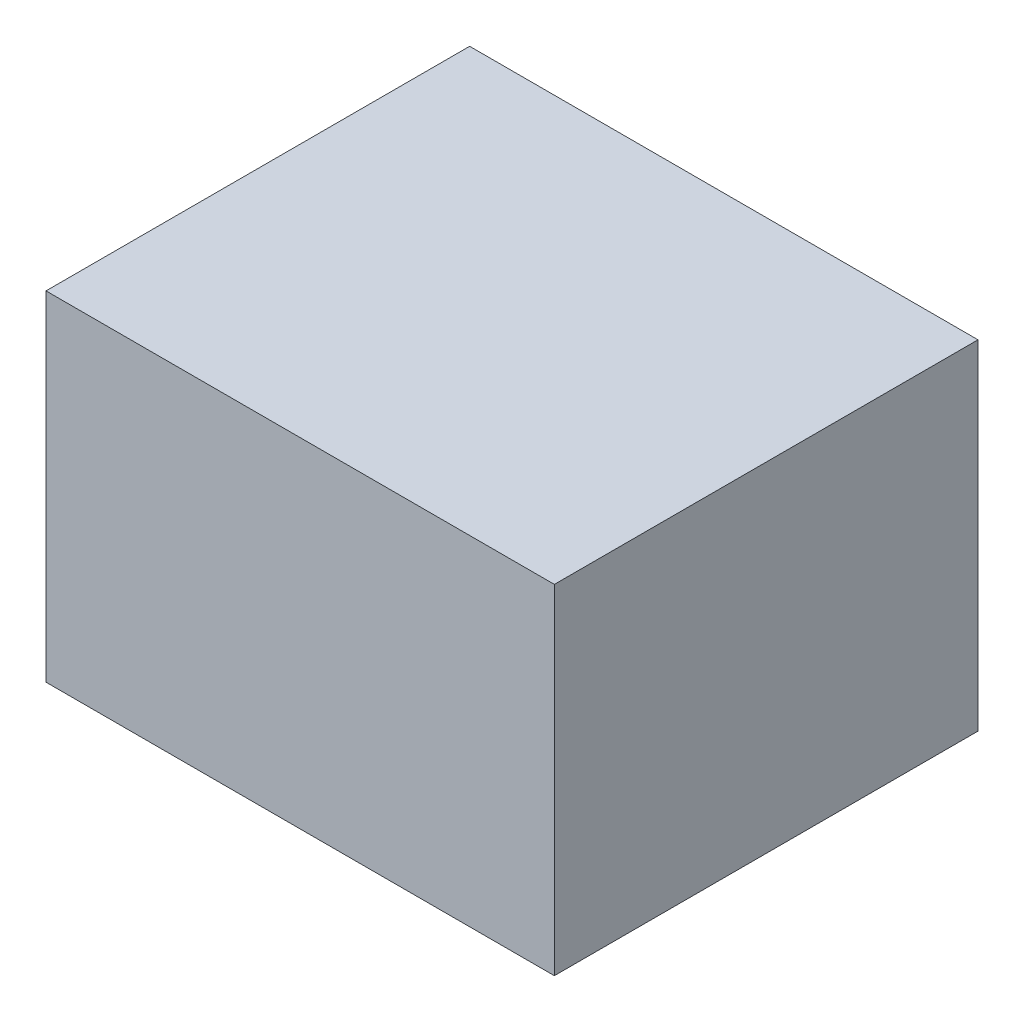
ISO-10303-21;
HEADER;
FILE_DESCRIPTION(('STEP AP214'),'2;1');
FILE_NAME('part.step','',(''),(''),'','','');
FILE_SCHEMA(('AUTOMOTIVE_DESIGN { 1 0 10303 214 1 1 1 1 }'));
ENDSEC;
DATA;
#1=APPLICATION_CONTEXT('core data for automotive mechanical design processes');
#2=APPLICATION_PROTOCOL_DEFINITION('international standard','automotive_design',2000,#1);
#3=PRODUCT_CONTEXT('',#1,'mechanical');
#4=PRODUCT('Part','Part','',(#3));
#5=PRODUCT_RELATED_PRODUCT_CATEGORY('part','',(#4));
#6=PRODUCT_DEFINITION_FORMATION('','',#4);
#7=PRODUCT_DEFINITION_CONTEXT('part definition',#1,'design');
#8=PRODUCT_DEFINITION('design','',#6,#7);
#9=PRODUCT_DEFINITION_SHAPE('','',#8);
#10=(LENGTH_UNIT() NAMED_UNIT(*) SI_UNIT(.MILLI.,.METRE.));
#11=(NAMED_UNIT(*) PLANE_ANGLE_UNIT() SI_UNIT($,.RADIAN.));
#12=(NAMED_UNIT(*) SI_UNIT($,.STERADIAN.) SOLID_ANGLE_UNIT());
#13=UNCERTAINTY_MEASURE_WITH_UNIT(LENGTH_MEASURE(1.E-05),#10,'distance_accuracy_value','');
#14=(GEOMETRIC_REPRESENTATION_CONTEXT(3) GLOBAL_UNCERTAINTY_ASSIGNED_CONTEXT((#13)) GLOBAL_UNIT_ASSIGNED_CONTEXT((#10,
#11,#12)) REPRESENTATION_CONTEXT('',''));
#15=CARTESIAN_POINT('',(0.,0.,0.));
#16=DIRECTION('',(0.,0.,1.));
#17=DIRECTION('',(1.,0.,0.));
#18=AXIS2_PLACEMENT_3D('',#15,#16,#17);
#19=CARTESIAN_POINT('',(19.05,-12.7,-15.875));
#20=DIRECTION('',(0.,0.,1.));
#21=DIRECTION('',(1.,0.,0.));
#22=AXIS2_PLACEMENT_3D('',#19,#20,#21);
#23=PLANE('',#22);
#24=DIRECTION('',(0.,1.,0.));
#25=VECTOR('',#24,1.);
#26=CARTESIAN_POINT('',(-19.05,-12.7,-15.875));
#27=LINE('',#26,#25);
#28=CARTESIAN_POINT('',(-19.05,-12.7,-15.875));
#29=VERTEX_POINT('',#28);
#30=CARTESIAN_POINT('',(-19.05,12.7,-15.875));
#31=VERTEX_POINT('',#30);
#32=EDGE_CURVE('E100',#29,#31,#27,.T.);
#33=ORIENTED_EDGE('',*,*,#32,.T.);
#34=DIRECTION('',(-1.,0.,0.));
#35=VECTOR('',#34,1.);
#36=CARTESIAN_POINT('',(19.05,12.7,-15.875));
#37=LINE('',#36,#35);
#38=CARTESIAN_POINT('',(19.05,12.7,-15.875));
#39=VERTEX_POINT('',#38);
#40=EDGE_CURVE('E11',#39,#31,#37,.T.);
#41=ORIENTED_EDGE('',*,*,#40,.F.);
#42=DIRECTION('',(0.,1.,0.));
#43=VECTOR('',#42,1.);
#44=CARTESIAN_POINT('',(19.05,-12.7,-15.875));
#45=LINE('',#44,#43);
#46=CARTESIAN_POINT('',(19.05,-12.7,-15.875));
#47=VERTEX_POINT('',#46);
#48=EDGE_CURVE('E88',#47,#39,#45,.T.);
#49=ORIENTED_EDGE('',*,*,#48,.F.);
#50=DIRECTION('',(-1.,0.,0.));
#51=VECTOR('',#50,1.);
#52=CARTESIAN_POINT('',(19.05,-12.7,-15.875));
#53=LINE('',#52,#51);
#54=EDGE_CURVE('E96',#47,#29,#53,.T.);
#55=ORIENTED_EDGE('',*,*,#54,.T.);
#56=EDGE_LOOP('',(#33,#41,#49,#55));
#57=FACE_BOUND('',#56,.T.);
#58=ADVANCED_FACE('F37',(#57),#23,.F.);
#59=CARTESIAN_POINT('',(19.05,12.7,15.875));
#60=DIRECTION('',(0.,-1.,0.));
#61=DIRECTION('',(0.,0.,-1.));
#62=AXIS2_PLACEMENT_3D('',#59,#60,#61);
#63=PLANE('',#62);
#64=DIRECTION('',(0.,0.,1.));
#65=VECTOR('',#64,1.);
#66=CARTESIAN_POINT('',(-19.05,12.7,15.875));
#67=LINE('',#66,#65);
#68=CARTESIAN_POINT('',(-19.05,12.7,15.875));
#69=VERTEX_POINT('',#68);
#70=EDGE_CURVE('E92',#31,#69,#67,.T.);
#71=ORIENTED_EDGE('',*,*,#70,.T.);
#72=DIRECTION('',(-1.,0.,0.));
#73=VECTOR('',#72,1.);
#74=CARTESIAN_POINT('',(19.05,12.7,15.875));
#75=LINE('',#74,#73);
#76=CARTESIAN_POINT('',(19.05,12.7,15.875));
#77=VERTEX_POINT('',#76);
#78=EDGE_CURVE('E45',#77,#69,#75,.T.);
#79=ORIENTED_EDGE('',*,*,#78,.F.);
#80=DIRECTION('',(0.,0.,1.));
#81=VECTOR('',#80,1.);
#82=CARTESIAN_POINT('',(19.05,12.7,15.875));
#83=LINE('',#82,#81);
#84=EDGE_CURVE('E83',#39,#77,#83,.T.);
#85=ORIENTED_EDGE('',*,*,#84,.F.);
#86=ORIENTED_EDGE('',*,*,#40,.T.);
#87=EDGE_LOOP('',(#71,#79,#85,#86));
#88=FACE_BOUND('',#87,.T.);
#89=ADVANCED_FACE('F91',(#88),#63,.F.);
#90=CARTESIAN_POINT('',(19.05,-12.7,15.875));
#91=DIRECTION('',(0.,0.,-1.));
#92=DIRECTION('',(-1.,0.,0.));
#93=AXIS2_PLACEMENT_3D('',#90,#91,#92);
#94=PLANE('',#93);
#95=DIRECTION('',(0.,-1.,0.));
#96=VECTOR('',#95,1.);
#97=CARTESIAN_POINT('',(-19.05,-12.7,15.875));
#98=LINE('',#97,#96);
#99=CARTESIAN_POINT('',(-19.05,-12.7,15.875));
#100=VERTEX_POINT('',#99);
#101=EDGE_CURVE('E70',#69,#100,#98,.T.);
#102=ORIENTED_EDGE('',*,*,#101,.T.);
#103=DIRECTION('',(-1.,0.,0.));
#104=VECTOR('',#103,1.);
#105=CARTESIAN_POINT('',(19.05,-12.7,15.875));
#106=LINE('',#105,#104);
#107=CARTESIAN_POINT('',(19.05,-12.7,15.875));
#108=VERTEX_POINT('',#107);
#109=EDGE_CURVE('E93',#108,#100,#106,.T.);
#110=ORIENTED_EDGE('',*,*,#109,.F.);
#111=DIRECTION('',(0.,-1.,0.));
#112=VECTOR('',#111,1.);
#113=CARTESIAN_POINT('',(19.05,-12.7,15.875));
#114=LINE('',#113,#112);
#115=EDGE_CURVE('E86',#77,#108,#114,.T.);
#116=ORIENTED_EDGE('',*,*,#115,.F.);
#117=ORIENTED_EDGE('',*,*,#78,.T.);
#118=EDGE_LOOP('',(#102,#110,#116,#117));
#119=FACE_BOUND('',#118,.T.);
#120=ADVANCED_FACE('F94',(#119),#94,.F.);
#121=CARTESIAN_POINT('',(19.05,-12.7,15.875));
#122=DIRECTION('',(0.,1.,0.));
#123=DIRECTION('',(0.,0.,1.));
#124=AXIS2_PLACEMENT_3D('',#121,#122,#123);
#125=PLANE('',#124);
#126=DIRECTION('',(0.,0.,-1.));
#127=VECTOR('',#126,1.);
#128=CARTESIAN_POINT('',(-19.05,-12.7,15.875));
#129=LINE('',#128,#127);
#130=EDGE_CURVE('E76',#100,#29,#129,.T.);
#131=ORIENTED_EDGE('',*,*,#130,.T.);
#132=ORIENTED_EDGE('',*,*,#54,.F.);
#133=DIRECTION('',(0.,0.,-1.));
#134=VECTOR('',#133,1.);
#135=CARTESIAN_POINT('',(19.05,-12.7,15.875));
#136=LINE('',#135,#134);
#137=EDGE_CURVE('E53',#108,#47,#136,.T.);
#138=ORIENTED_EDGE('',*,*,#137,.F.);
#139=ORIENTED_EDGE('',*,*,#109,.T.);
#140=EDGE_LOOP('',(#131,#132,#138,#139));
#141=FACE_BOUND('',#140,.T.);
#142=ADVANCED_FACE('F107',(#141),#125,.F.);
#143=CARTESIAN_POINT('',(19.05,0.,0.));
#144=DIRECTION('',(-1.,0.,0.));
#145=DIRECTION('',(0.,0.,1.));
#146=AXIS2_PLACEMENT_3D('',#143,#144,#145);
#147=PLANE('',#146);
#148=ORIENTED_EDGE('',*,*,#48,.T.);
#149=ORIENTED_EDGE('',*,*,#84,.T.);
#150=ORIENTED_EDGE('',*,*,#115,.T.);
#151=ORIENTED_EDGE('',*,*,#137,.T.);
#152=EDGE_LOOP('',(#148,#149,#150,#151));
#153=FACE_BOUND('',#152,.T.);
#154=ADVANCED_FACE('F84',(#153),#147,.F.);
#155=CARTESIAN_POINT('',(-19.05,0.,0.));
#156=DIRECTION('',(-1.,0.,0.));
#157=DIRECTION('',(0.,0.,1.));
#158=AXIS2_PLACEMENT_3D('',#155,#156,#157);
#159=PLANE('',#158);
#160=ORIENTED_EDGE('',*,*,#32,.F.);
#161=ORIENTED_EDGE('',*,*,#130,.F.);
#162=ORIENTED_EDGE('',*,*,#101,.F.);
#163=ORIENTED_EDGE('',*,*,#70,.F.);
#164=EDGE_LOOP('',(#160,#161,#162,#163));
#165=FACE_BOUND('',#164,.T.);
#166=ADVANCED_FACE('F110',(#165),#159,.T.);
#167=CLOSED_SHELL('',(#58,#89,#120,#142,#154,#166));
#168=MANIFOLD_SOLID_BREP('B2',#167);
#169=ADVANCED_BREP_SHAPE_REPRESENTATION('',(#18,#168),#14);
#170=SHAPE_DEFINITION_REPRESENTATION(#9,#169);
ENDSEC;
END-ISO-10303-21;
